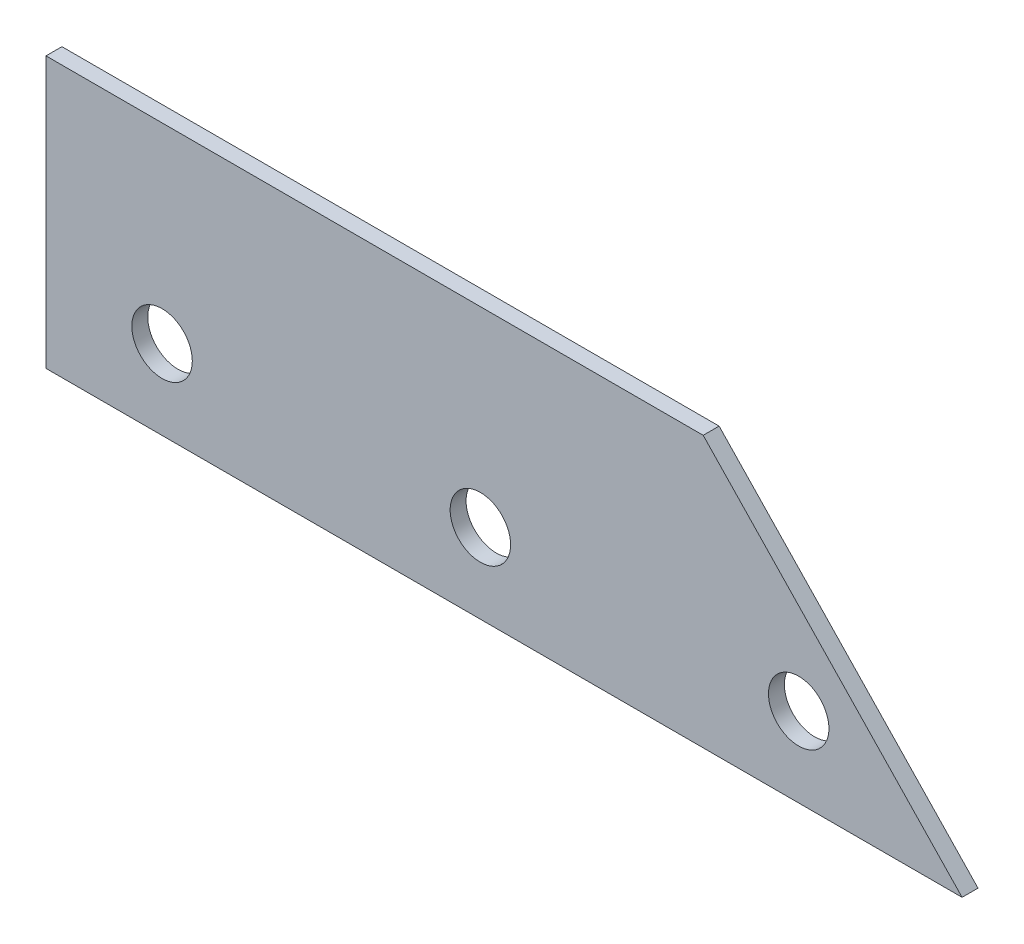
ISO-10303-21;
HEADER;
FILE_DESCRIPTION(('STEP AP214'),'2;1');
FILE_NAME('part.step','',(''),(''),'','','');
FILE_SCHEMA(('AUTOMOTIVE_DESIGN { 1 0 10303 214 1 1 1 1 }'));
ENDSEC;
DATA;
#1=APPLICATION_CONTEXT('core data for automotive mechanical design processes');
#2=APPLICATION_PROTOCOL_DEFINITION('international standard','automotive_design',2000,#1);
#3=PRODUCT_CONTEXT('',#1,'mechanical');
#4=PRODUCT('Part','Part','',(#3));
#5=PRODUCT_RELATED_PRODUCT_CATEGORY('part','',(#4));
#6=PRODUCT_DEFINITION_FORMATION('','',#4);
#7=PRODUCT_DEFINITION_CONTEXT('part definition',#1,'design');
#8=PRODUCT_DEFINITION('design','',#6,#7);
#9=PRODUCT_DEFINITION_SHAPE('','',#8);
#10=(LENGTH_UNIT() NAMED_UNIT(*) SI_UNIT(.MILLI.,.METRE.));
#11=(NAMED_UNIT(*) PLANE_ANGLE_UNIT() SI_UNIT($,.RADIAN.));
#12=(NAMED_UNIT(*) SI_UNIT($,.STERADIAN.) SOLID_ANGLE_UNIT());
#13=UNCERTAINTY_MEASURE_WITH_UNIT(LENGTH_MEASURE(1.E-05),#10,'distance_accuracy_value','');
#14=(GEOMETRIC_REPRESENTATION_CONTEXT(3) GLOBAL_UNCERTAINTY_ASSIGNED_CONTEXT((#13)) GLOBAL_UNIT_ASSIGNED_CONTEXT((#10,
#11,#12)) REPRESENTATION_CONTEXT('',''));
#15=CARTESIAN_POINT('',(0.,0.,0.));
#16=DIRECTION('',(0.,0.,1.));
#17=DIRECTION('',(1.,0.,0.));
#18=AXIS2_PLACEMENT_3D('',#15,#16,#17);
#19=CARTESIAN_POINT('',(0.,0.,1.));
#20=DIRECTION('',(0.,0.,1.));
#21=DIRECTION('',(1.,0.,0.));
#22=AXIS2_PLACEMENT_3D('',#19,#20,#21);
#23=PLANE('',#22);
#24=CARTESIAN_POINT('',(72.5935335759817,10.375,1.));
#25=DIRECTION('',(0.,0.,1.));
#26=DIRECTION('',(1.,0.,0.));
#27=AXIS2_PLACEMENT_3D('',#24,#25,#26);
#28=CIRCLE('',#27,1.9);
#29=CARTESIAN_POINT('',(74.4935335759817,10.375,1.));
#30=VERTEX_POINT('',#29);
#31=EDGE_CURVE('E114',#30,#30,#28,.T.);
#32=ORIENTED_EDGE('',*,*,#31,.F.);
#33=EDGE_LOOP('',(#32));
#34=FACE_BOUND('',#33,.T.);
#35=DIRECTION('',(0.,-1.,0.));
#36=VECTOR('',#35,1.);
#37=CARTESIAN_POINT('',(45.3013587726411,22.3838764884269,1.));
#38=LINE('',#37,#36);
#39=CARTESIAN_POINT('',(45.3013587726411,22.3838764884269,1.));
#40=VERTEX_POINT('',#39);
#41=CARTESIAN_POINT('',(45.3013587726411,5.37499999999999,1.));
#42=VERTEX_POINT('',#41);
#43=EDGE_CURVE('E84',#40,#42,#38,.T.);
#44=ORIENTED_EDGE('',*,*,#43,.T.);
#45=DIRECTION('',(1.,0.,0.));
#46=VECTOR('',#45,1.);
#47=CARTESIAN_POINT('',(45.3013587726411,5.37499999999999,1.));
#48=LINE('',#47,#46);
#49=CARTESIAN_POINT('',(102.85970372073,5.375,1.));
#50=VERTEX_POINT('',#49);
#51=EDGE_CURVE('E79',#42,#50,#48,.T.);
#52=ORIENTED_EDGE('',*,*,#51,.T.);
#53=DIRECTION('',(-0.691151860847974,0.722709558015101,0.));
#54=VECTOR('',#53,1.);
#55=CARTESIAN_POINT('',(102.85970372073,5.375,1.));
#56=LINE('',#55,#54);
#57=CARTESIAN_POINT('',(86.5935335759817,22.3838764884269,1.));
#58=VERTEX_POINT('',#57);
#59=EDGE_CURVE('E82',#50,#58,#56,.T.);
#60=ORIENTED_EDGE('',*,*,#59,.T.);
#61=DIRECTION('',(-1.,0.,0.));
#62=VECTOR('',#61,1.);
#63=CARTESIAN_POINT('',(86.5935335759817,22.3838764884269,1.));
#64=LINE('',#63,#62);
#65=EDGE_CURVE('E49',#58,#40,#64,.T.);
#66=ORIENTED_EDGE('',*,*,#65,.T.);
#67=EDGE_LOOP('',(#44,#52,#60,#66));
#68=FACE_BOUND('',#67,.T.);
#69=CARTESIAN_POINT('',(92.5935335759817,10.375,1.));
#70=DIRECTION('',(0.,0.,1.));
#71=DIRECTION('',(1.,0.,0.));
#72=AXIS2_PLACEMENT_3D('',#69,#70,#71);
#73=CIRCLE('',#72,1.9);
#74=CARTESIAN_POINT('',(94.4935335759817,10.375,1.));
#75=VERTEX_POINT('',#74);
#76=EDGE_CURVE('E99',#75,#75,#73,.T.);
#77=ORIENTED_EDGE('',*,*,#76,.F.);
#78=EDGE_LOOP('',(#77));
#79=FACE_BOUND('',#78,.T.);
#80=CARTESIAN_POINT('',(52.5935335759817,10.375,1.));
#81=DIRECTION('',(0.,0.,1.));
#82=DIRECTION('',(1.,0.,0.));
#83=AXIS2_PLACEMENT_3D('',#80,#81,#82);
#84=CIRCLE('',#83,1.90000000000001);
#85=CARTESIAN_POINT('',(54.4935335759817,10.375,1.));
#86=VERTEX_POINT('',#85);
#87=EDGE_CURVE('E120',#86,#86,#84,.T.);
#88=ORIENTED_EDGE('',*,*,#87,.F.);
#89=EDGE_LOOP('',(#88));
#90=FACE_BOUND('',#89,.T.);
#91=ADVANCED_FACE('F32',(#34,#68,#79,#90),#23,.T.);
#92=CARTESIAN_POINT('',(0.,0.,0.));
#93=DIRECTION('',(0.,0.,1.));
#94=DIRECTION('',(1.,0.,0.));
#95=AXIS2_PLACEMENT_3D('',#92,#93,#94);
#96=PLANE('',#95);
#97=DIRECTION('',(0.,-1.,0.));
#98=VECTOR('',#97,1.);
#99=CARTESIAN_POINT('',(45.3013587726411,22.3838764884269,0.));
#100=LINE('',#99,#98);
#101=CARTESIAN_POINT('',(45.3013587726411,22.3838764884269,0.));
#102=VERTEX_POINT('',#101);
#103=CARTESIAN_POINT('',(45.3013587726411,5.37499999999999,0.));
#104=VERTEX_POINT('',#103);
#105=EDGE_CURVE('E96',#102,#104,#100,.T.);
#106=ORIENTED_EDGE('',*,*,#105,.F.);
#107=DIRECTION('',(-1.,0.,0.));
#108=VECTOR('',#107,1.);
#109=CARTESIAN_POINT('',(86.5935335759817,22.3838764884269,0.));
#110=LINE('',#109,#108);
#111=CARTESIAN_POINT('',(86.5935335759817,22.3838764884269,0.));
#112=VERTEX_POINT('',#111);
#113=EDGE_CURVE('E72',#112,#102,#110,.T.);
#114=ORIENTED_EDGE('',*,*,#113,.F.);
#115=DIRECTION('',(-0.691151860847974,0.722709558015101,0.));
#116=VECTOR('',#115,1.);
#117=CARTESIAN_POINT('',(102.85970372073,5.375,0.));
#118=LINE('',#117,#116);
#119=CARTESIAN_POINT('',(102.85970372073,5.375,0.));
#120=VERTEX_POINT('',#119);
#121=EDGE_CURVE('E66',#120,#112,#118,.T.);
#122=ORIENTED_EDGE('',*,*,#121,.F.);
#123=DIRECTION('',(1.,0.,0.));
#124=VECTOR('',#123,1.);
#125=CARTESIAN_POINT('',(45.3013587726411,5.37499999999999,0.));
#126=LINE('',#125,#124);
#127=EDGE_CURVE('E88',#104,#120,#126,.T.);
#128=ORIENTED_EDGE('',*,*,#127,.F.);
#129=EDGE_LOOP('',(#106,#114,#122,#128));
#130=FACE_BOUND('',#129,.T.);
#131=CARTESIAN_POINT('',(92.5935335759817,10.375,0.));
#132=DIRECTION('',(0.,0.,1.));
#133=DIRECTION('',(1.,0.,0.));
#134=AXIS2_PLACEMENT_3D('',#131,#132,#133);
#135=CIRCLE('',#134,1.9);
#136=CARTESIAN_POINT('',(94.4935335759817,10.375,0.));
#137=VERTEX_POINT('',#136);
#138=EDGE_CURVE('E111',#137,#137,#135,.T.);
#139=ORIENTED_EDGE('',*,*,#138,.T.);
#140=EDGE_LOOP('',(#139));
#141=FACE_BOUND('',#140,.T.);
#142=CARTESIAN_POINT('',(72.5935335759817,10.375,0.));
#143=DIRECTION('',(0.,0.,1.));
#144=DIRECTION('',(1.,0.,0.));
#145=AXIS2_PLACEMENT_3D('',#142,#143,#144);
#146=CIRCLE('',#145,1.9);
#147=CARTESIAN_POINT('',(74.4935335759817,10.375,0.));
#148=VERTEX_POINT('',#147);
#149=EDGE_CURVE('E117',#148,#148,#146,.T.);
#150=ORIENTED_EDGE('',*,*,#149,.T.);
#151=EDGE_LOOP('',(#150));
#152=FACE_BOUND('',#151,.T.);
#153=CARTESIAN_POINT('',(52.5935335759817,10.375,0.));
#154=DIRECTION('',(0.,0.,1.));
#155=DIRECTION('',(1.,0.,0.));
#156=AXIS2_PLACEMENT_3D('',#153,#154,#155);
#157=CIRCLE('',#156,1.90000000000001);
#158=CARTESIAN_POINT('',(54.4935335759817,10.375,0.));
#159=VERTEX_POINT('',#158);
#160=EDGE_CURVE('E123',#159,#159,#157,.T.);
#161=ORIENTED_EDGE('',*,*,#160,.T.);
#162=EDGE_LOOP('',(#161));
#163=FACE_BOUND('',#162,.T.);
#164=ADVANCED_FACE('F107',(#130,#141,#152,#163),#96,.F.);
#165=CARTESIAN_POINT('',(45.3013587726411,22.3838764884269,1.));
#166=DIRECTION('',(1.,0.,0.));
#167=DIRECTION('',(0.,0.,-1.));
#168=AXIS2_PLACEMENT_3D('',#165,#166,#167);
#169=PLANE('',#168);
#170=ORIENTED_EDGE('',*,*,#105,.T.);
#171=DIRECTION('',(0.,0.,-1.));
#172=VECTOR('',#171,1.);
#173=CARTESIAN_POINT('',(45.3013587726411,5.37499999999999,1.));
#174=LINE('',#173,#172);
#175=EDGE_CURVE('E11',#42,#104,#174,.T.);
#176=ORIENTED_EDGE('',*,*,#175,.F.);
#177=ORIENTED_EDGE('',*,*,#43,.F.);
#178=DIRECTION('',(0.,0.,-1.));
#179=VECTOR('',#178,1.);
#180=CARTESIAN_POINT('',(45.3013587726411,22.3838764884269,1.));
#181=LINE('',#180,#179);
#182=EDGE_CURVE('E92',#40,#102,#181,.T.);
#183=ORIENTED_EDGE('',*,*,#182,.T.);
#184=EDGE_LOOP('',(#170,#176,#177,#183));
#185=FACE_BOUND('',#184,.T.);
#186=ADVANCED_FACE('F34',(#185),#169,.F.);
#187=CARTESIAN_POINT('',(45.3013587726411,5.37499999999999,1.));
#188=DIRECTION('',(0.,1.,0.));
#189=DIRECTION('',(-1.,0.,0.));
#190=AXIS2_PLACEMENT_3D('',#187,#188,#189);
#191=PLANE('',#190);
#192=ORIENTED_EDGE('',*,*,#127,.T.);
#193=DIRECTION('',(0.,0.,-1.));
#194=VECTOR('',#193,1.);
#195=CARTESIAN_POINT('',(102.85970372073,5.375,1.));
#196=LINE('',#195,#194);
#197=EDGE_CURVE('E41',#50,#120,#196,.T.);
#198=ORIENTED_EDGE('',*,*,#197,.F.);
#199=ORIENTED_EDGE('',*,*,#51,.F.);
#200=ORIENTED_EDGE('',*,*,#175,.T.);
#201=EDGE_LOOP('',(#192,#198,#199,#200));
#202=FACE_BOUND('',#201,.T.);
#203=ADVANCED_FACE('F87',(#202),#191,.F.);
#204=CARTESIAN_POINT('',(102.85970372073,5.375,1.));
#205=DIRECTION('',(-0.722709558015101,-0.691151860847974,0.));
#206=DIRECTION('',(0.691151860847974,-0.722709558015102,0.));
#207=AXIS2_PLACEMENT_3D('',#204,#205,#206);
#208=PLANE('',#207);
#209=ORIENTED_EDGE('',*,*,#121,.T.);
#210=DIRECTION('',(0.,0.,-1.));
#211=VECTOR('',#210,1.);
#212=CARTESIAN_POINT('',(86.5935335759817,22.3838764884269,1.));
#213=LINE('',#212,#211);
#214=EDGE_CURVE('E89',#58,#112,#213,.T.);
#215=ORIENTED_EDGE('',*,*,#214,.F.);
#216=ORIENTED_EDGE('',*,*,#59,.F.);
#217=ORIENTED_EDGE('',*,*,#197,.T.);
#218=EDGE_LOOP('',(#209,#215,#216,#217));
#219=FACE_BOUND('',#218,.T.);
#220=ADVANCED_FACE('F90',(#219),#208,.F.);
#221=CARTESIAN_POINT('',(86.5935335759817,22.3838764884269,1.));
#222=DIRECTION('',(0.,-1.,0.));
#223=DIRECTION('',(1.,0.,0.));
#224=AXIS2_PLACEMENT_3D('',#221,#222,#223);
#225=PLANE('',#224);
#226=ORIENTED_EDGE('',*,*,#113,.T.);
#227=ORIENTED_EDGE('',*,*,#182,.F.);
#228=ORIENTED_EDGE('',*,*,#65,.F.);
#229=ORIENTED_EDGE('',*,*,#214,.T.);
#230=EDGE_LOOP('',(#226,#227,#228,#229));
#231=FACE_BOUND('',#230,.T.);
#232=ADVANCED_FACE('F104',(#231),#225,.F.);
#233=CARTESIAN_POINT('',(92.5935335759817,10.375,1.));
#234=DIRECTION('',(0.,0.,-1.));
#235=DIRECTION('',(-1.,0.,0.));
#236=AXIS2_PLACEMENT_3D('',#233,#234,#235);
#237=CYLINDRICAL_SURFACE('',#236,1.9);
#238=ORIENTED_EDGE('',*,*,#76,.T.);
#239=EDGE_LOOP('',(#238));
#240=FACE_BOUND('',#239,.T.);
#241=ORIENTED_EDGE('',*,*,#138,.F.);
#242=EDGE_LOOP('',(#241));
#243=FACE_BOUND('',#242,.T.);
#244=ADVANCED_FACE('F141',(#240,#243),#237,.F.);
#245=CARTESIAN_POINT('',(72.5935335759817,10.375,1.));
#246=DIRECTION('',(0.,0.,-1.));
#247=DIRECTION('',(-1.,0.,0.));
#248=AXIS2_PLACEMENT_3D('',#245,#246,#247);
#249=CYLINDRICAL_SURFACE('',#248,1.9);
#250=ORIENTED_EDGE('',*,*,#31,.T.);
#251=EDGE_LOOP('',(#250));
#252=FACE_BOUND('',#251,.T.);
#253=ORIENTED_EDGE('',*,*,#149,.F.);
#254=EDGE_LOOP('',(#253));
#255=FACE_BOUND('',#254,.T.);
#256=ADVANCED_FACE('F187',(#252,#255),#249,.F.);
#257=CARTESIAN_POINT('',(52.5935335759817,10.375,1.));
#258=DIRECTION('',(0.,0.,-1.));
#259=DIRECTION('',(-1.,0.,0.));
#260=AXIS2_PLACEMENT_3D('',#257,#258,#259);
#261=CYLINDRICAL_SURFACE('',#260,1.90000000000001);
#262=ORIENTED_EDGE('',*,*,#87,.T.);
#263=EDGE_LOOP('',(#262));
#264=FACE_BOUND('',#263,.T.);
#265=ORIENTED_EDGE('',*,*,#160,.F.);
#266=EDGE_LOOP('',(#265));
#267=FACE_BOUND('',#266,.T.);
#268=ADVANCED_FACE('F129',(#264,#267),#261,.F.);
#269=CLOSED_SHELL('',(#91,#164,#186,#203,#220,#232,#244,#256,#268));
#270=MANIFOLD_SOLID_BREP('B2',#269);
#271=ADVANCED_BREP_SHAPE_REPRESENTATION('',(#18,#270),#14);
#272=SHAPE_DEFINITION_REPRESENTATION(#9,#271);
ENDSEC;
END-ISO-10303-21;
